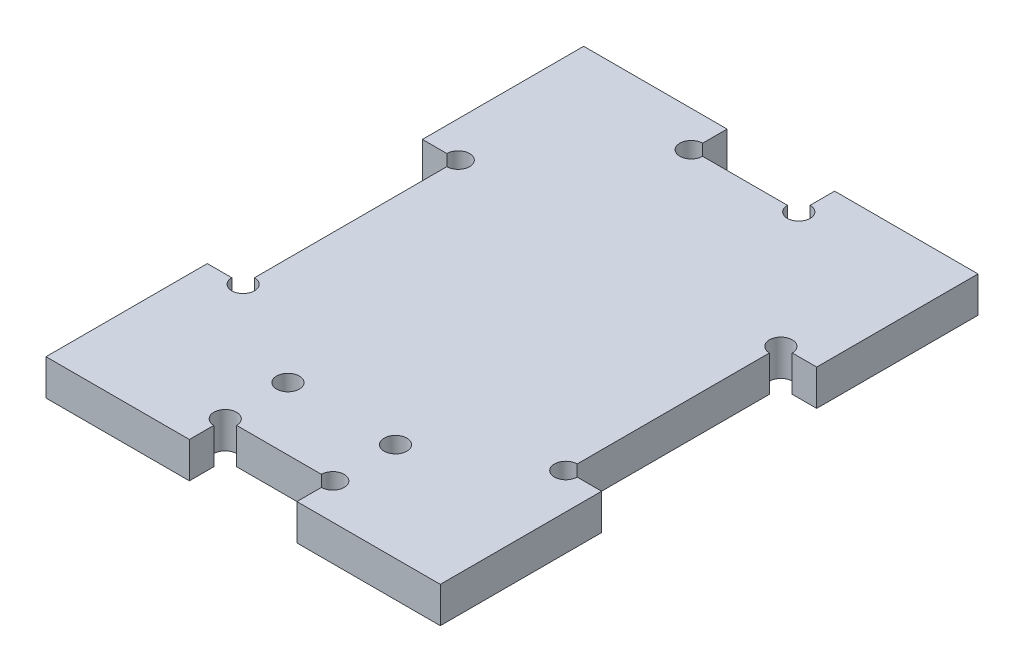
ISO-10303-21;
HEADER;
FILE_DESCRIPTION(('STEP AP214'),'2;1');
FILE_NAME('part.step','',(''),(''),'','','');
FILE_SCHEMA(('AUTOMOTIVE_DESIGN { 1 0 10303 214 1 1 1 1 }'));
ENDSEC;
DATA;
#1=APPLICATION_CONTEXT('core data for automotive mechanical design processes');
#2=APPLICATION_PROTOCOL_DEFINITION('international standard','automotive_design',2000,#1);
#3=PRODUCT_CONTEXT('',#1,'mechanical');
#4=PRODUCT('Part','Part','',(#3));
#5=PRODUCT_RELATED_PRODUCT_CATEGORY('part','',(#4));
#6=PRODUCT_DEFINITION_FORMATION('','',#4);
#7=PRODUCT_DEFINITION_CONTEXT('part definition',#1,'design');
#8=PRODUCT_DEFINITION('design','',#6,#7);
#9=PRODUCT_DEFINITION_SHAPE('','',#8);
#10=(LENGTH_UNIT() NAMED_UNIT(*) SI_UNIT(.MILLI.,.METRE.));
#11=(NAMED_UNIT(*) PLANE_ANGLE_UNIT() SI_UNIT($,.RADIAN.));
#12=(NAMED_UNIT(*) SI_UNIT($,.STERADIAN.) SOLID_ANGLE_UNIT());
#13=UNCERTAINTY_MEASURE_WITH_UNIT(LENGTH_MEASURE(1.E-05),#10,'distance_accuracy_value','');
#14=(GEOMETRIC_REPRESENTATION_CONTEXT(3) GLOBAL_UNCERTAINTY_ASSIGNED_CONTEXT((#13)) GLOBAL_UNIT_ASSIGNED_CONTEXT((#10,
#11,#12)) REPRESENTATION_CONTEXT('',''));
#15=CARTESIAN_POINT('',(0.,0.,0.));
#16=DIRECTION('',(0.,0.,1.));
#17=DIRECTION('',(1.,0.,0.));
#18=AXIS2_PLACEMENT_3D('',#15,#16,#17);
#19=CARTESIAN_POINT('',(0.,5.,0.));
#20=DIRECTION('',(1.,0.,0.));
#21=DIRECTION('',(0.,0.,-1.));
#22=AXIS2_PLACEMENT_3D('',#19,#20,#21);
#23=PLANE('',#22);
#24=DIRECTION('',(0.,0.,1.));
#25=VECTOR('',#24,1.);
#26=CARTESIAN_POINT('',(0.,0.,0.));
#27=LINE('',#26,#25);
#28=CARTESIAN_POINT('',(0.,0.,-75.));
#29=VERTEX_POINT('',#28);
#30=CARTESIAN_POINT('',(0.,0.,-52.5));
#31=VERTEX_POINT('',#30);
#32=EDGE_CURVE('E286',#29,#31,#27,.T.);
#33=ORIENTED_EDGE('',*,*,#32,.T.);
#34=DIRECTION('',(0.,1.,0.));
#35=VECTOR('',#34,1.);
#36=CARTESIAN_POINT('',(0.,0.,-52.5));
#37=LINE('',#36,#35);
#38=CARTESIAN_POINT('',(0.,5.,-52.5));
#39=VERTEX_POINT('',#38);
#40=EDGE_CURVE('E380',#31,#39,#37,.T.);
#41=ORIENTED_EDGE('',*,*,#40,.T.);
#42=DIRECTION('',(0.,0.,1.));
#43=VECTOR('',#42,1.);
#44=CARTESIAN_POINT('',(0.,5.,0.));
#45=LINE('',#44,#43);
#46=CARTESIAN_POINT('',(0.,5.,-75.));
#47=VERTEX_POINT('',#46);
#48=EDGE_CURVE('E265',#47,#39,#45,.T.);
#49=ORIENTED_EDGE('',*,*,#48,.F.);
#50=DIRECTION('',(0.,-1.,0.));
#51=VECTOR('',#50,1.);
#52=CARTESIAN_POINT('',(0.,5.,-75.));
#53=LINE('',#52,#51);
#54=EDGE_CURVE('E285',#47,#29,#53,.T.);
#55=ORIENTED_EDGE('',*,*,#54,.T.);
#56=EDGE_LOOP('',(#33,#41,#49,#55));
#57=FACE_BOUND('',#56,.T.);
#58=ADVANCED_FACE('F39',(#57),#23,.F.);
#59=CARTESIAN_POINT('',(0.,5.,0.));
#60=DIRECTION('',(0.,0.,-1.));
#61=DIRECTION('',(-1.,0.,0.));
#62=AXIS2_PLACEMENT_3D('',#59,#60,#61);
#63=PLANE('',#62);
#64=DIRECTION('',(1.,0.,0.));
#65=VECTOR('',#64,1.);
#66=CARTESIAN_POINT('',(0.,0.,0.));
#67=LINE('',#66,#65);
#68=CARTESIAN_POINT('',(0.,0.,0.));
#69=VERTEX_POINT('',#68);
#70=CARTESIAN_POINT('',(20.,0.,0.));
#71=VERTEX_POINT('',#70);
#72=EDGE_CURVE('E291',#69,#71,#67,.T.);
#73=ORIENTED_EDGE('',*,*,#72,.T.);
#74=DIRECTION('',(0.,1.,0.));
#75=VECTOR('',#74,1.);
#76=CARTESIAN_POINT('',(20.,0.,0.));
#77=LINE('',#76,#75);
#78=CARTESIAN_POINT('',(20.,5.,0.));
#79=VERTEX_POINT('',#78);
#80=EDGE_CURVE('E364',#71,#79,#77,.T.);
#81=ORIENTED_EDGE('',*,*,#80,.T.);
#82=DIRECTION('',(1.,0.,0.));
#83=VECTOR('',#82,1.);
#84=CARTESIAN_POINT('',(0.,5.,0.));
#85=LINE('',#84,#83);
#86=CARTESIAN_POINT('',(0.,5.,0.));
#87=VERTEX_POINT('',#86);
#88=EDGE_CURVE('E271',#87,#79,#85,.T.);
#89=ORIENTED_EDGE('',*,*,#88,.F.);
#90=DIRECTION('',(0.,-1.,0.));
#91=VECTOR('',#90,1.);
#92=CARTESIAN_POINT('',(0.,5.,0.));
#93=LINE('',#92,#91);
#94=EDGE_CURVE('E316',#87,#69,#93,.T.);
#95=ORIENTED_EDGE('',*,*,#94,.T.);
#96=EDGE_LOOP('',(#73,#81,#89,#95));
#97=FACE_BOUND('',#96,.T.);
#98=ADVANCED_FACE('F481',(#97),#63,.F.);
#99=CARTESIAN_POINT('',(55.,5.,0.));
#100=DIRECTION('',(-1.,0.,0.));
#101=DIRECTION('',(0.,0.,1.));
#102=AXIS2_PLACEMENT_3D('',#99,#100,#101);
#103=PLANE('',#102);
#104=DIRECTION('',(0.,0.,-1.));
#105=VECTOR('',#104,1.);
#106=CARTESIAN_POINT('',(55.,0.,0.));
#107=LINE('',#106,#105);
#108=CARTESIAN_POINT('',(55.,0.,0.));
#109=VERTEX_POINT('',#108);
#110=CARTESIAN_POINT('',(55.,0.,-22.5));
#111=VERTEX_POINT('',#110);
#112=EDGE_CURVE('E296',#109,#111,#107,.T.);
#113=ORIENTED_EDGE('',*,*,#112,.T.);
#114=DIRECTION('',(0.,1.,0.));
#115=VECTOR('',#114,1.);
#116=CARTESIAN_POINT('',(55.,0.,-22.5));
#117=LINE('',#116,#115);
#118=CARTESIAN_POINT('',(55.,5.,-22.5));
#119=VERTEX_POINT('',#118);
#120=EDGE_CURVE('E445',#111,#119,#117,.T.);
#121=ORIENTED_EDGE('',*,*,#120,.T.);
#122=DIRECTION('',(0.,0.,-1.));
#123=VECTOR('',#122,1.);
#124=CARTESIAN_POINT('',(55.,5.,0.));
#125=LINE('',#124,#123);
#126=CARTESIAN_POINT('',(55.,5.,0.));
#127=VERTEX_POINT('',#126);
#128=EDGE_CURVE('E276',#127,#119,#125,.T.);
#129=ORIENTED_EDGE('',*,*,#128,.F.);
#130=DIRECTION('',(0.,-1.,0.));
#131=VECTOR('',#130,1.);
#132=CARTESIAN_POINT('',(55.,5.,0.));
#133=LINE('',#132,#131);
#134=EDGE_CURVE('E312',#127,#109,#133,.T.);
#135=ORIENTED_EDGE('',*,*,#134,.T.);
#136=EDGE_LOOP('',(#113,#121,#129,#135));
#137=FACE_BOUND('',#136,.T.);
#138=ADVANCED_FACE('F603',(#137),#103,.F.);
#139=CARTESIAN_POINT('',(0.,5.,-75.));
#140=DIRECTION('',(0.,0.,1.));
#141=DIRECTION('',(1.,0.,0.));
#142=AXIS2_PLACEMENT_3D('',#139,#140,#141);
#143=PLANE('',#142);
#144=DIRECTION('',(-1.,0.,0.));
#145=VECTOR('',#144,1.);
#146=CARTESIAN_POINT('',(0.,0.,-75.));
#147=LINE('',#146,#145);
#148=CARTESIAN_POINT('',(55.,0.,-75.));
#149=VERTEX_POINT('',#148);
#150=CARTESIAN_POINT('',(35.,0.,-75.));
#151=VERTEX_POINT('',#150);
#152=EDGE_CURVE('E301',#149,#151,#147,.T.);
#153=ORIENTED_EDGE('',*,*,#152,.T.);
#154=DIRECTION('',(0.,1.,0.));
#155=VECTOR('',#154,1.);
#156=CARTESIAN_POINT('',(35.,0.,-75.));
#157=LINE('',#156,#155);
#158=CARTESIAN_POINT('',(35.,5.,-75.));
#159=VERTEX_POINT('',#158);
#160=EDGE_CURVE('E416',#151,#159,#157,.T.);
#161=ORIENTED_EDGE('',*,*,#160,.T.);
#162=DIRECTION('',(-1.,0.,0.));
#163=VECTOR('',#162,1.);
#164=CARTESIAN_POINT('',(0.,5.,-75.));
#165=LINE('',#164,#163);
#166=CARTESIAN_POINT('',(55.,5.,-75.));
#167=VERTEX_POINT('',#166);
#168=EDGE_CURVE('E281',#167,#159,#165,.T.);
#169=ORIENTED_EDGE('',*,*,#168,.F.);
#170=DIRECTION('',(0.,-1.,0.));
#171=VECTOR('',#170,1.);
#172=CARTESIAN_POINT('',(55.,5.,-75.));
#173=LINE('',#172,#171);
#174=EDGE_CURVE('E308',#167,#149,#173,.T.);
#175=ORIENTED_EDGE('',*,*,#174,.T.);
#176=EDGE_LOOP('',(#153,#161,#169,#175));
#177=FACE_BOUND('',#176,.T.);
#178=ADVANCED_FACE('F419',(#177),#143,.F.);
#179=CARTESIAN_POINT('',(0.,5.,-22.5));
#180=VERTEX_POINT('',#179);
#181=EDGE_CURVE('E270',#180,#87,#45,.T.);
#182=ORIENTED_EDGE('',*,*,#181,.F.);
#183=DIRECTION('',(0.,1.,0.));
#184=VECTOR('',#183,1.);
#185=CARTESIAN_POINT('',(0.,0.,-22.5));
#186=LINE('',#185,#184);
#187=CARTESIAN_POINT('',(0.,0.,-22.5));
#188=VERTEX_POINT('',#187);
#189=EDGE_CURVE('E475',#188,#180,#186,.T.);
#190=ORIENTED_EDGE('',*,*,#189,.F.);
#191=EDGE_CURVE('E259',#188,#69,#27,.T.);
#192=ORIENTED_EDGE('',*,*,#191,.T.);
#193=ORIENTED_EDGE('',*,*,#94,.F.);
#194=EDGE_LOOP('',(#182,#190,#192,#193));
#195=FACE_BOUND('',#194,.T.);
#196=ADVANCED_FACE('F41',(#195),#23,.F.);
#197=CARTESIAN_POINT('',(35.,5.,0.));
#198=VERTEX_POINT('',#197);
#199=EDGE_CURVE('E269',#198,#127,#85,.T.);
#200=ORIENTED_EDGE('',*,*,#199,.F.);
#201=DIRECTION('',(0.,1.,0.));
#202=VECTOR('',#201,1.);
#203=CARTESIAN_POINT('',(35.,0.,0.));
#204=LINE('',#203,#202);
#205=CARTESIAN_POINT('',(35.,0.,0.));
#206=VERTEX_POINT('',#205);
#207=EDGE_CURVE('E370',#206,#198,#204,.T.);
#208=ORIENTED_EDGE('',*,*,#207,.F.);
#209=EDGE_CURVE('E290',#206,#109,#67,.T.);
#210=ORIENTED_EDGE('',*,*,#209,.T.);
#211=ORIENTED_EDGE('',*,*,#134,.F.);
#212=EDGE_LOOP('',(#200,#208,#210,#211));
#213=FACE_BOUND('',#212,.T.);
#214=ADVANCED_FACE('F604',(#213),#63,.F.);
#215=CARTESIAN_POINT('',(55.,5.,-52.5));
#216=VERTEX_POINT('',#215);
#217=EDGE_CURVE('E275',#216,#167,#125,.T.);
#218=ORIENTED_EDGE('',*,*,#217,.F.);
#219=DIRECTION('',(0.,1.,0.));
#220=VECTOR('',#219,1.);
#221=CARTESIAN_POINT('',(55.,0.,-52.5));
#222=LINE('',#221,#220);
#223=CARTESIAN_POINT('',(55.,0.,-52.5));
#224=VERTEX_POINT('',#223);
#225=EDGE_CURVE('E444',#224,#216,#222,.T.);
#226=ORIENTED_EDGE('',*,*,#225,.F.);
#227=EDGE_CURVE('E295',#224,#149,#107,.T.);
#228=ORIENTED_EDGE('',*,*,#227,.T.);
#229=ORIENTED_EDGE('',*,*,#174,.F.);
#230=EDGE_LOOP('',(#218,#226,#228,#229));
#231=FACE_BOUND('',#230,.T.);
#232=ADVANCED_FACE('F459',(#231),#103,.F.);
#233=CARTESIAN_POINT('',(20.,5.,-75.));
#234=VERTEX_POINT('',#233);
#235=EDGE_CURVE('E280',#234,#47,#165,.T.);
#236=ORIENTED_EDGE('',*,*,#235,.F.);
#237=DIRECTION('',(0.,1.,0.));
#238=VECTOR('',#237,1.);
#239=CARTESIAN_POINT('',(20.,0.,-75.));
#240=LINE('',#239,#238);
#241=CARTESIAN_POINT('',(20.,0.,-75.));
#242=VERTEX_POINT('',#241);
#243=EDGE_CURVE('E422',#242,#234,#240,.T.);
#244=ORIENTED_EDGE('',*,*,#243,.F.);
#245=EDGE_CURVE('E300',#242,#29,#147,.T.);
#246=ORIENTED_EDGE('',*,*,#245,.T.);
#247=ORIENTED_EDGE('',*,*,#54,.F.);
#248=EDGE_LOOP('',(#236,#244,#246,#247));
#249=FACE_BOUND('',#248,.T.);
#250=ADVANCED_FACE('F509',(#249),#143,.F.);
#251=CARTESIAN_POINT('',(0.,5.,0.));
#252=DIRECTION('',(0.,-1.,0.));
#253=DIRECTION('',(0.,0.,-1.));
#254=AXIS2_PLACEMENT_3D('',#251,#252,#253);
#255=PLANE('',#254);
#256=CARTESIAN_POINT('',(35.,5.,-13.75));
#257=DIRECTION('',(0.,1.,0.));
#258=DIRECTION('',(0.,0.,1.));
#259=AXIS2_PLACEMENT_3D('',#256,#257,#258);
#260=CIRCLE('',#259,1.5875);
#261=CARTESIAN_POINT('',(35.,5.,-12.1625));
#262=VERTEX_POINT('',#261);
#263=EDGE_CURVE('E523',#262,#262,#260,.T.);
#264=ORIENTED_EDGE('',*,*,#263,.F.);
#265=EDGE_LOOP('',(#264));
#266=FACE_BOUND('',#265,.T.);
#267=CARTESIAN_POINT('',(20.,5.,-13.75));
#268=DIRECTION('',(0.,1.,0.));
#269=DIRECTION('',(0.,0.,1.));
#270=AXIS2_PLACEMENT_3D('',#267,#268,#269);
#271=CIRCLE('',#270,1.5875);
#272=CARTESIAN_POINT('',(20.,5.,-12.1625));
#273=VERTEX_POINT('',#272);
#274=EDGE_CURVE('E884',#273,#273,#271,.T.);
#275=ORIENTED_EDGE('',*,*,#274,.F.);
#276=EDGE_LOOP('',(#275));
#277=FACE_BOUND('',#276,.T.);
#278=DIRECTION('',(0.,0.,-1.));
#279=VECTOR('',#278,1.);
#280=CARTESIAN_POINT('',(50.,5.,0.));
#281=LINE('',#280,#279);
#282=CARTESIAN_POINT('',(50.,5.,-24.0875));
#283=VERTEX_POINT('',#282);
#284=CARTESIAN_POINT('',(50.,5.,-50.9125));
#285=VERTEX_POINT('',#284);
#286=EDGE_CURVE('E391',#283,#285,#281,.T.);
#287=ORIENTED_EDGE('',*,*,#286,.T.);
#288=CARTESIAN_POINT('',(50.,5.,-52.5));
#289=DIRECTION('',(0.,1.,0.));
#290=DIRECTION('',(0.,0.,1.));
#291=AXIS2_PLACEMENT_3D('',#288,#289,#290);
#292=CIRCLE('',#291,1.5875);
#293=CARTESIAN_POINT('',(51.5875,5.,-52.5));
#294=VERTEX_POINT('',#293);
#295=EDGE_CURVE('E535',#294,#285,#292,.T.);
#296=ORIENTED_EDGE('',*,*,#295,.F.);
#297=DIRECTION('',(1.,0.,0.));
#298=VECTOR('',#297,1.);
#299=CARTESIAN_POINT('',(0.,5.,-52.4999999999999));
#300=LINE('',#299,#298);
#301=EDGE_CURVE('E388',#294,#216,#300,.T.);
#302=ORIENTED_EDGE('',*,*,#301,.T.);
#303=ORIENTED_EDGE('',*,*,#217,.T.);
#304=ORIENTED_EDGE('',*,*,#168,.T.);
#305=DIRECTION('',(0.,0.,1.));
#306=VECTOR('',#305,1.);
#307=CARTESIAN_POINT('',(34.9999999999996,5.,1.94289029309401E-13));
#308=LINE('',#307,#306);
#309=CARTESIAN_POINT('',(35.,5.,-71.5875));
#310=VERTEX_POINT('',#309);
#311=EDGE_CURVE('E261',#159,#310,#308,.T.);
#312=ORIENTED_EDGE('',*,*,#311,.T.);
#313=CARTESIAN_POINT('',(35.,5.,-70.));
#314=DIRECTION('',(0.,1.,0.));
#315=DIRECTION('',(0.,0.,1.));
#316=AXIS2_PLACEMENT_3D('',#313,#314,#315);
#317=CIRCLE('',#316,1.5875);
#318=CARTESIAN_POINT('',(33.4125,5.,-70.));
#319=VERTEX_POINT('',#318);
#320=EDGE_CURVE('E407',#319,#310,#317,.T.);
#321=ORIENTED_EDGE('',*,*,#320,.F.);
#322=DIRECTION('',(-1.,0.,0.));
#323=VECTOR('',#322,1.);
#324=CARTESIAN_POINT('',(0.,5.,-70.));
#325=LINE('',#324,#323);
#326=CARTESIAN_POINT('',(21.5875,5.,-70.));
#327=VERTEX_POINT('',#326);
#328=EDGE_CURVE('E401',#319,#327,#325,.T.);
#329=ORIENTED_EDGE('',*,*,#328,.T.);
#330=CARTESIAN_POINT('',(20.,5.,-70.));
#331=DIRECTION('',(0.,1.,0.));
#332=DIRECTION('',(0.,0.,1.));
#333=AXIS2_PLACEMENT_3D('',#330,#331,#332);
#334=CIRCLE('',#333,1.5875);
#335=CARTESIAN_POINT('',(20.,5.,-71.5875));
#336=VERTEX_POINT('',#335);
#337=EDGE_CURVE('E513',#336,#327,#334,.T.);
#338=ORIENTED_EDGE('',*,*,#337,.F.);
#339=DIRECTION('',(0.,0.,-1.));
#340=VECTOR('',#339,1.);
#341=CARTESIAN_POINT('',(20.0000000000001,5.,0.));
#342=LINE('',#341,#340);
#343=EDGE_CURVE('E398',#336,#234,#342,.T.);
#344=ORIENTED_EDGE('',*,*,#343,.T.);
#345=ORIENTED_EDGE('',*,*,#235,.T.);
#346=ORIENTED_EDGE('',*,*,#48,.T.);
#347=DIRECTION('',(1.,0.,0.));
#348=VECTOR('',#347,1.);
#349=CARTESIAN_POINT('',(0.,5.,-52.5));
#350=LINE('',#349,#348);
#351=CARTESIAN_POINT('',(3.41249999999999,5.,-52.5));
#352=VERTEX_POINT('',#351);
#353=EDGE_CURVE('E254',#39,#352,#350,.T.);
#354=ORIENTED_EDGE('',*,*,#353,.T.);
#355=CARTESIAN_POINT('',(4.99999999999999,5.,-52.5));
#356=DIRECTION('',(0.,1.,0.));
#357=DIRECTION('',(0.,0.,1.));
#358=AXIS2_PLACEMENT_3D('',#355,#356,#357);
#359=CIRCLE('',#358,1.5875);
#360=CARTESIAN_POINT('',(4.99999999999999,5.,-50.9125));
#361=VERTEX_POINT('',#360);
#362=EDGE_CURVE('E252',#361,#352,#359,.T.);
#363=ORIENTED_EDGE('',*,*,#362,.F.);
#364=DIRECTION('',(0.,0.,1.));
#365=VECTOR('',#364,1.);
#366=CARTESIAN_POINT('',(4.99999999999999,5.,0.));
#367=LINE('',#366,#365);
#368=CARTESIAN_POINT('',(4.99999999999999,5.,-24.0875));
#369=VERTEX_POINT('',#368);
#370=EDGE_CURVE('E241',#361,#369,#367,.T.);
#371=ORIENTED_EDGE('',*,*,#370,.T.);
#372=CARTESIAN_POINT('',(4.99999999999999,5.,-22.5));
#373=DIRECTION('',(0.,1.,0.));
#374=DIRECTION('',(0.,0.,1.));
#375=AXIS2_PLACEMENT_3D('',#372,#373,#374);
#376=CIRCLE('',#375,1.5875);
#377=CARTESIAN_POINT('',(3.41249999999999,5.,-22.5));
#378=VERTEX_POINT('',#377);
#379=EDGE_CURVE('E223',#378,#369,#376,.T.);
#380=ORIENTED_EDGE('',*,*,#379,.F.);
#381=DIRECTION('',(-1.,0.,0.));
#382=VECTOR('',#381,1.);
#383=CARTESIAN_POINT('',(0.,5.,-22.5));
#384=LINE('',#383,#382);
#385=EDGE_CURVE('E255',#378,#180,#384,.T.);
#386=ORIENTED_EDGE('',*,*,#385,.T.);
#387=ORIENTED_EDGE('',*,*,#181,.T.);
#388=ORIENTED_EDGE('',*,*,#88,.T.);
#389=DIRECTION('',(0.,0.,-1.));
#390=VECTOR('',#389,1.);
#391=CARTESIAN_POINT('',(20.,5.,0.));
#392=LINE('',#391,#390);
#393=CARTESIAN_POINT('',(20.,5.,-3.41249999999999));
#394=VERTEX_POINT('',#393);
#395=EDGE_CURVE('E384',#79,#394,#392,.T.);
#396=ORIENTED_EDGE('',*,*,#395,.T.);
#397=CARTESIAN_POINT('',(20.,5.,-4.99999999999999));
#398=DIRECTION('',(0.,1.,0.));
#399=DIRECTION('',(0.,0.,1.));
#400=AXIS2_PLACEMENT_3D('',#397,#398,#399);
#401=CIRCLE('',#400,1.5875);
#402=CARTESIAN_POINT('',(21.5875,5.,-4.99999999999999));
#403=VERTEX_POINT('',#402);
#404=EDGE_CURVE('E548',#403,#394,#401,.T.);
#405=ORIENTED_EDGE('',*,*,#404,.F.);
#406=DIRECTION('',(1.,0.,0.));
#407=VECTOR('',#406,1.);
#408=CARTESIAN_POINT('',(0.,5.,-4.99999999999998));
#409=LINE('',#408,#407);
#410=CARTESIAN_POINT('',(33.4125,5.,-4.99999999999999));
#411=VERTEX_POINT('',#410);
#412=EDGE_CURVE('E379',#403,#411,#409,.T.);
#413=ORIENTED_EDGE('',*,*,#412,.T.);
#414=CARTESIAN_POINT('',(35.,5.,-4.99999999999999));
#415=DIRECTION('',(0.,1.,0.));
#416=DIRECTION('',(0.,0.,1.));
#417=AXIS2_PLACEMENT_3D('',#414,#415,#416);
#418=CIRCLE('',#417,1.5875);
#419=CARTESIAN_POINT('',(35.,5.,-3.41249999999999));
#420=VERTEX_POINT('',#419);
#421=EDGE_CURVE('E553',#420,#411,#418,.T.);
#422=ORIENTED_EDGE('',*,*,#421,.F.);
#423=DIRECTION('',(0.,0.,1.));
#424=VECTOR('',#423,1.);
#425=CARTESIAN_POINT('',(35.,5.,-1.94289029309403E-13));
#426=LINE('',#425,#424);
#427=EDGE_CURVE('E348',#420,#198,#426,.T.);
#428=ORIENTED_EDGE('',*,*,#427,.T.);
#429=ORIENTED_EDGE('',*,*,#199,.T.);
#430=ORIENTED_EDGE('',*,*,#128,.T.);
#431=DIRECTION('',(-1.,0.,0.));
#432=VECTOR('',#431,1.);
#433=CARTESIAN_POINT('',(0.,5.,-22.5));
#434=LINE('',#433,#432);
#435=CARTESIAN_POINT('',(51.5875,5.,-22.5));
#436=VERTEX_POINT('',#435);
#437=EDGE_CURVE('E394',#119,#436,#434,.T.);
#438=ORIENTED_EDGE('',*,*,#437,.T.);
#439=CARTESIAN_POINT('',(50.,5.,-22.5));
#440=DIRECTION('',(0.,1.,0.));
#441=DIRECTION('',(0.,0.,1.));
#442=AXIS2_PLACEMENT_3D('',#439,#440,#441);
#443=CIRCLE('',#442,1.5875);
#444=EDGE_CURVE('E534',#283,#436,#443,.T.);
#445=ORIENTED_EDGE('',*,*,#444,.F.);
#446=EDGE_LOOP('',(#287,#296,#302,#303,#304,#312,#321,#329,#338,#344,#345,#346,#354,#363,#371,
#380,#386,#387,#388,#396,#405,#413,#422,#428,#429,#430,#438,#445));
#447=FACE_BOUND('',#446,.T.);
#448=ADVANCED_FACE('F250',(#266,#277,#447),#255,.F.);
#449=CARTESIAN_POINT('',(0.,0.,0.));
#450=DIRECTION('',(0.,-1.,0.));
#451=DIRECTION('',(0.,0.,-1.));
#452=AXIS2_PLACEMENT_3D('',#449,#450,#451);
#453=PLANE('',#452);
#454=CARTESIAN_POINT('',(50.,0.,-52.5));
#455=DIRECTION('',(0.,1.,0.));
#456=DIRECTION('',(0.,0.,1.));
#457=AXIS2_PLACEMENT_3D('',#454,#455,#456);
#458=CIRCLE('',#457,1.5875);
#459=CARTESIAN_POINT('',(51.5875,0.,-52.5));
#460=VERTEX_POINT('',#459);
#461=CARTESIAN_POINT('',(50.,0.,-50.9125));
#462=VERTEX_POINT('',#461);
#463=EDGE_CURVE('E531',#460,#462,#458,.T.);
#464=ORIENTED_EDGE('',*,*,#463,.T.);
#465=DIRECTION('',(0.,0.,1.));
#466=VECTOR('',#465,1.);
#467=CARTESIAN_POINT('',(50.,0.,-52.5));
#468=LINE('',#467,#466);
#469=CARTESIAN_POINT('',(50.,0.,-24.0875));
#470=VERTEX_POINT('',#469);
#471=EDGE_CURVE('E437',#462,#470,#468,.T.);
#472=ORIENTED_EDGE('',*,*,#471,.T.);
#473=CARTESIAN_POINT('',(50.,0.,-22.5));
#474=DIRECTION('',(0.,1.,0.));
#475=DIRECTION('',(0.,0.,1.));
#476=AXIS2_PLACEMENT_3D('',#473,#474,#475);
#477=CIRCLE('',#476,1.5875);
#478=CARTESIAN_POINT('',(51.5875,0.,-22.5));
#479=VERTEX_POINT('',#478);
#480=EDGE_CURVE('E556',#470,#479,#477,.T.);
#481=ORIENTED_EDGE('',*,*,#480,.T.);
#482=DIRECTION('',(1.,0.,0.));
#483=VECTOR('',#482,1.);
#484=CARTESIAN_POINT('',(55.,0.,-22.5));
#485=LINE('',#484,#483);
#486=EDGE_CURVE('E441',#479,#111,#485,.T.);
#487=ORIENTED_EDGE('',*,*,#486,.T.);
#488=ORIENTED_EDGE('',*,*,#112,.F.);
#489=ORIENTED_EDGE('',*,*,#209,.F.);
#490=DIRECTION('',(0.,0.,-1.));
#491=VECTOR('',#490,1.);
#492=CARTESIAN_POINT('',(35.,0.,0.));
#493=LINE('',#492,#491);
#494=CARTESIAN_POINT('',(35.,0.,-3.41249999999999));
#495=VERTEX_POINT('',#494);
#496=EDGE_CURVE('E346',#206,#495,#493,.T.);
#497=ORIENTED_EDGE('',*,*,#496,.T.);
#498=CARTESIAN_POINT('',(35.,0.,-4.99999999999999));
#499=DIRECTION('',(0.,1.,0.));
#500=DIRECTION('',(0.,0.,1.));
#501=AXIS2_PLACEMENT_3D('',#498,#499,#500);
#502=CIRCLE('',#501,1.5875);
#503=CARTESIAN_POINT('',(33.4125,0.,-4.99999999999999));
#504=VERTEX_POINT('',#503);
#505=EDGE_CURVE('E62',#495,#504,#502,.T.);
#506=ORIENTED_EDGE('',*,*,#505,.T.);
#507=DIRECTION('',(-1.,0.,0.));
#508=VECTOR('',#507,1.);
#509=CARTESIAN_POINT('',(20.,0.,-4.99999999999999));
#510=LINE('',#509,#508);
#511=CARTESIAN_POINT('',(21.5875,0.,-4.99999999999999));
#512=VERTEX_POINT('',#511);
#513=EDGE_CURVE('E359',#504,#512,#510,.T.);
#514=ORIENTED_EDGE('',*,*,#513,.T.);
#515=CARTESIAN_POINT('',(20.,0.,-4.99999999999999));
#516=DIRECTION('',(0.,1.,0.));
#517=DIRECTION('',(0.,0.,1.));
#518=AXIS2_PLACEMENT_3D('',#515,#516,#517);
#519=CIRCLE('',#518,1.5875);
#520=CARTESIAN_POINT('',(20.,0.,-3.41249999999999));
#521=VERTEX_POINT('',#520);
#522=EDGE_CURVE('E55',#512,#521,#519,.T.);
#523=ORIENTED_EDGE('',*,*,#522,.T.);
#524=DIRECTION('',(0.,0.,1.));
#525=VECTOR('',#524,1.);
#526=CARTESIAN_POINT('',(20.,0.,0.));
#527=LINE('',#526,#525);
#528=EDGE_CURVE('E360',#521,#71,#527,.T.);
#529=ORIENTED_EDGE('',*,*,#528,.T.);
#530=ORIENTED_EDGE('',*,*,#72,.F.);
#531=ORIENTED_EDGE('',*,*,#191,.F.);
#532=DIRECTION('',(1.,0.,0.));
#533=VECTOR('',#532,1.);
#534=CARTESIAN_POINT('',(0.,0.,-22.5));
#535=LINE('',#534,#533);
#536=CARTESIAN_POINT('',(3.41249999999999,0.,-22.5));
#537=VERTEX_POINT('',#536);
#538=EDGE_CURVE('E428',#188,#537,#535,.T.);
#539=ORIENTED_EDGE('',*,*,#538,.T.);
#540=CARTESIAN_POINT('',(4.99999999999999,0.,-22.5));
#541=DIRECTION('',(0.,1.,0.));
#542=DIRECTION('',(0.,0.,1.));
#543=AXIS2_PLACEMENT_3D('',#540,#541,#542);
#544=CIRCLE('',#543,1.5875);
#545=CARTESIAN_POINT('',(4.99999999999999,0.,-24.0875));
#546=VERTEX_POINT('',#545);
#547=EDGE_CURVE('E234',#537,#546,#544,.T.);
#548=ORIENTED_EDGE('',*,*,#547,.T.);
#549=DIRECTION('',(0.,0.,-1.));
#550=VECTOR('',#549,1.);
#551=CARTESIAN_POINT('',(4.99999999999999,0.,-22.5));
#552=LINE('',#551,#550);
#553=CARTESIAN_POINT('',(4.99999999999999,0.,-50.9125));
#554=VERTEX_POINT('',#553);
#555=EDGE_CURVE('E243',#546,#554,#552,.T.);
#556=ORIENTED_EDGE('',*,*,#555,.T.);
#557=CARTESIAN_POINT('',(4.99999999999999,0.,-52.5));
#558=DIRECTION('',(0.,1.,0.));
#559=DIRECTION('',(0.,0.,1.));
#560=AXIS2_PLACEMENT_3D('',#557,#558,#559);
#561=CIRCLE('',#560,1.5875);
#562=CARTESIAN_POINT('',(3.41249999999999,0.,-52.5));
#563=VERTEX_POINT('',#562);
#564=EDGE_CURVE('E246',#554,#563,#561,.T.);
#565=ORIENTED_EDGE('',*,*,#564,.T.);
#566=DIRECTION('',(-1.,0.,0.));
#567=VECTOR('',#566,1.);
#568=CARTESIAN_POINT('',(0.,0.,-52.5));
#569=LINE('',#568,#567);
#570=EDGE_CURVE('E486',#563,#31,#569,.T.);
#571=ORIENTED_EDGE('',*,*,#570,.T.);
#572=ORIENTED_EDGE('',*,*,#32,.F.);
#573=ORIENTED_EDGE('',*,*,#245,.F.);
#574=DIRECTION('',(0.,0.,1.));
#575=VECTOR('',#574,1.);
#576=CARTESIAN_POINT('',(20.,0.,-75.));
#577=LINE('',#576,#575);
#578=CARTESIAN_POINT('',(20.,0.,-71.5875));
#579=VERTEX_POINT('',#578);
#580=EDGE_CURVE('E431',#242,#579,#577,.T.);
#581=ORIENTED_EDGE('',*,*,#580,.T.);
#582=CARTESIAN_POINT('',(20.,0.,-70.));
#583=DIRECTION('',(0.,1.,0.));
#584=DIRECTION('',(0.,0.,1.));
#585=AXIS2_PLACEMENT_3D('',#582,#583,#584);
#586=CIRCLE('',#585,1.5875);
#587=CARTESIAN_POINT('',(21.5875,0.,-70.));
#588=VERTEX_POINT('',#587);
#589=EDGE_CURVE('E500',#579,#588,#586,.T.);
#590=ORIENTED_EDGE('',*,*,#589,.T.);
#591=DIRECTION('',(1.,0.,0.));
#592=VECTOR('',#591,1.);
#593=CARTESIAN_POINT('',(35.,0.,-70.));
#594=LINE('',#593,#592);
#595=CARTESIAN_POINT('',(33.4125,0.,-70.));
#596=VERTEX_POINT('',#595);
#597=EDGE_CURVE('E423',#588,#596,#594,.T.);
#598=ORIENTED_EDGE('',*,*,#597,.T.);
#599=CARTESIAN_POINT('',(35.,0.,-70.));
#600=DIRECTION('',(0.,1.,0.));
#601=DIRECTION('',(0.,0.,1.));
#602=AXIS2_PLACEMENT_3D('',#599,#600,#601);
#603=CIRCLE('',#602,1.5875);
#604=CARTESIAN_POINT('',(35.,0.,-71.5875));
#605=VERTEX_POINT('',#604);
#606=EDGE_CURVE('E538',#596,#605,#603,.T.);
#607=ORIENTED_EDGE('',*,*,#606,.T.);
#608=DIRECTION('',(0.,0.,-1.));
#609=VECTOR('',#608,1.);
#610=CARTESIAN_POINT('',(35.,0.,-75.));
#611=LINE('',#610,#609);
#612=EDGE_CURVE('E448',#605,#151,#611,.T.);
#613=ORIENTED_EDGE('',*,*,#612,.T.);
#614=ORIENTED_EDGE('',*,*,#152,.F.);
#615=ORIENTED_EDGE('',*,*,#227,.F.);
#616=DIRECTION('',(-1.,0.,0.));
#617=VECTOR('',#616,1.);
#618=CARTESIAN_POINT('',(55.,0.,-52.5));
#619=LINE('',#618,#617);
#620=EDGE_CURVE('E373',#224,#460,#619,.T.);
#621=ORIENTED_EDGE('',*,*,#620,.T.);
#622=EDGE_LOOP('',(#464,#472,#481,#487,#488,#489,#497,#506,#514,#523,#529,#530,#531,#539,#548,
#556,#565,#571,#572,#573,#581,#590,#598,#607,#613,#614,#615,#621));
#623=FACE_BOUND('',#622,.T.);
#624=CARTESIAN_POINT('',(35.,0.,-13.75));
#625=DIRECTION('',(0.,1.,0.));
#626=DIRECTION('',(0.,0.,1.));
#627=AXIS2_PLACEMENT_3D('',#624,#625,#626);
#628=CIRCLE('',#627,1.5875);
#629=CARTESIAN_POINT('',(35.,0.,-12.1625));
#630=VERTEX_POINT('',#629);
#631=EDGE_CURVE('E517',#630,#630,#628,.T.);
#632=ORIENTED_EDGE('',*,*,#631,.T.);
#633=EDGE_LOOP('',(#632));
#634=FACE_BOUND('',#633,.T.);
#635=CARTESIAN_POINT('',(20.,0.,-13.75));
#636=DIRECTION('',(0.,1.,0.));
#637=DIRECTION('',(0.,0.,1.));
#638=AXIS2_PLACEMENT_3D('',#635,#636,#637);
#639=CIRCLE('',#638,1.5875);
#640=CARTESIAN_POINT('',(20.,0.,-12.1625));
#641=VERTEX_POINT('',#640);
#642=EDGE_CURVE('E530',#641,#641,#639,.T.);
#643=ORIENTED_EDGE('',*,*,#642,.T.);
#644=EDGE_LOOP('',(#643));
#645=FACE_BOUND('',#644,.T.);
#646=ADVANCED_FACE('F353',(#623,#634,#645),#453,.T.);
#647=CARTESIAN_POINT('',(20.,0.,0.));
#648=DIRECTION('',(-1.,0.,0.));
#649=DIRECTION('',(0.,0.,1.));
#650=AXIS2_PLACEMENT_3D('',#647,#648,#649);
#651=PLANE('',#650);
#652=ORIENTED_EDGE('',*,*,#528,.F.);
#653=DIRECTION('',(0.,1.,0.));
#654=VECTOR('',#653,1.);
#655=CARTESIAN_POINT('',(20.,0.,-3.41249999999999));
#656=LINE('',#655,#654);
#657=EDGE_CURVE('E366',#521,#394,#656,.T.);
#658=ORIENTED_EDGE('',*,*,#657,.T.);
#659=ORIENTED_EDGE('',*,*,#395,.F.);
#660=ORIENTED_EDGE('',*,*,#80,.F.);
#661=EDGE_LOOP('',(#652,#658,#659,#660));
#662=FACE_BOUND('',#661,.T.);
#663=ADVANCED_FACE('F661',(#662),#651,.F.);
#664=CARTESIAN_POINT('',(20.,0.,-4.99999999999999));
#665=DIRECTION('',(0.,0.,-1.));
#666=DIRECTION('',(-1.,0.,0.));
#667=AXIS2_PLACEMENT_3D('',#664,#665,#666);
#668=PLANE('',#667);
#669=ORIENTED_EDGE('',*,*,#513,.F.);
#670=DIRECTION('',(0.,1.,0.));
#671=VECTOR('',#670,1.);
#672=CARTESIAN_POINT('',(33.4125,0.,-4.99999999999999));
#673=LINE('',#672,#671);
#674=EDGE_CURVE('E583',#504,#411,#673,.T.);
#675=ORIENTED_EDGE('',*,*,#674,.T.);
#676=ORIENTED_EDGE('',*,*,#412,.F.);
#677=DIRECTION('',(0.,1.,0.));
#678=VECTOR('',#677,1.);
#679=CARTESIAN_POINT('',(21.5875,0.,-4.99999999999999));
#680=LINE('',#679,#678);
#681=EDGE_CURVE('E11',#403,#512,#680,.F.);
#682=ORIENTED_EDGE('',*,*,#681,.T.);
#683=EDGE_LOOP('',(#669,#675,#676,#682));
#684=FACE_BOUND('',#683,.T.);
#685=ADVANCED_FACE('F667',(#684),#668,.F.);
#686=CARTESIAN_POINT('',(35.,0.,0.));
#687=DIRECTION('',(1.,0.,0.));
#688=DIRECTION('',(0.,0.,-1.));
#689=AXIS2_PLACEMENT_3D('',#686,#687,#688);
#690=PLANE('',#689);
#691=ORIENTED_EDGE('',*,*,#427,.F.);
#692=DIRECTION('',(0.,1.,0.));
#693=VECTOR('',#692,1.);
#694=CARTESIAN_POINT('',(35.,0.,-3.41249999999999));
#695=LINE('',#694,#693);
#696=EDGE_CURVE('E48',#420,#495,#695,.F.);
#697=ORIENTED_EDGE('',*,*,#696,.T.);
#698=ORIENTED_EDGE('',*,*,#496,.F.);
#699=ORIENTED_EDGE('',*,*,#207,.T.);
#700=EDGE_LOOP('',(#691,#697,#698,#699));
#701=FACE_BOUND('',#700,.T.);
#702=ADVANCED_FACE('F344',(#701),#690,.F.);
#703=CARTESIAN_POINT('',(55.,0.,-22.5));
#704=DIRECTION('',(0.,0.,1.));
#705=DIRECTION('',(1.,0.,0.));
#706=AXIS2_PLACEMENT_3D('',#703,#704,#705);
#707=PLANE('',#706);
#708=ORIENTED_EDGE('',*,*,#486,.F.);
#709=DIRECTION('',(0.,1.,0.));
#710=VECTOR('',#709,1.);
#711=CARTESIAN_POINT('',(51.5875,0.,-22.5));
#712=LINE('',#711,#710);
#713=EDGE_CURVE('E579',#479,#436,#712,.T.);
#714=ORIENTED_EDGE('',*,*,#713,.T.);
#715=ORIENTED_EDGE('',*,*,#437,.F.);
#716=ORIENTED_EDGE('',*,*,#120,.F.);
#717=EDGE_LOOP('',(#708,#714,#715,#716));
#718=FACE_BOUND('',#717,.T.);
#719=ADVANCED_FACE('F685',(#718),#707,.F.);
#720=CARTESIAN_POINT('',(50.,0.,-52.5));
#721=DIRECTION('',(-1.,0.,0.));
#722=DIRECTION('',(0.,0.,1.));
#723=AXIS2_PLACEMENT_3D('',#720,#721,#722);
#724=PLANE('',#723);
#725=ORIENTED_EDGE('',*,*,#471,.F.);
#726=DIRECTION('',(0.,1.,0.));
#727=VECTOR('',#726,1.);
#728=CARTESIAN_POINT('',(50.,0.,-50.9125));
#729=LINE('',#728,#727);
#730=EDGE_CURVE('E575',#462,#285,#729,.T.);
#731=ORIENTED_EDGE('',*,*,#730,.T.);
#732=ORIENTED_EDGE('',*,*,#286,.F.);
#733=DIRECTION('',(0.,1.,0.));
#734=VECTOR('',#733,1.);
#735=CARTESIAN_POINT('',(50.,0.,-24.0875));
#736=LINE('',#735,#734);
#737=EDGE_CURVE('E337',#283,#470,#736,.F.);
#738=ORIENTED_EDGE('',*,*,#737,.T.);
#739=EDGE_LOOP('',(#725,#731,#732,#738));
#740=FACE_BOUND('',#739,.T.);
#741=ADVANCED_FACE('F693',(#740),#724,.F.);
#742=CARTESIAN_POINT('',(55.,0.,-52.5));
#743=DIRECTION('',(0.,0.,-1.));
#744=DIRECTION('',(-1.,0.,0.));
#745=AXIS2_PLACEMENT_3D('',#742,#743,#744);
#746=PLANE('',#745);
#747=ORIENTED_EDGE('',*,*,#301,.F.);
#748=DIRECTION('',(0.,1.,0.));
#749=VECTOR('',#748,1.);
#750=CARTESIAN_POINT('',(51.5875,0.,-52.5));
#751=LINE('',#750,#749);
#752=EDGE_CURVE('E333',#294,#460,#751,.F.);
#753=ORIENTED_EDGE('',*,*,#752,.T.);
#754=ORIENTED_EDGE('',*,*,#620,.F.);
#755=ORIENTED_EDGE('',*,*,#225,.T.);
#756=EDGE_LOOP('',(#747,#753,#754,#755));
#757=FACE_BOUND('',#756,.T.);
#758=ADVANCED_FACE('F455',(#757),#746,.F.);
#759=CARTESIAN_POINT('',(35.,0.,-75.));
#760=DIRECTION('',(1.,0.,0.));
#761=DIRECTION('',(0.,0.,-1.));
#762=AXIS2_PLACEMENT_3D('',#759,#760,#761);
#763=PLANE('',#762);
#764=ORIENTED_EDGE('',*,*,#612,.F.);
#765=DIRECTION('',(0.,1.,0.));
#766=VECTOR('',#765,1.);
#767=CARTESIAN_POINT('',(35.,0.,-71.5875));
#768=LINE('',#767,#766);
#769=EDGE_CURVE('E417',#605,#310,#768,.T.);
#770=ORIENTED_EDGE('',*,*,#769,.T.);
#771=ORIENTED_EDGE('',*,*,#311,.F.);
#772=ORIENTED_EDGE('',*,*,#160,.F.);
#773=EDGE_LOOP('',(#764,#770,#771,#772));
#774=FACE_BOUND('',#773,.T.);
#775=ADVANCED_FACE('F415',(#774),#763,.F.);
#776=CARTESIAN_POINT('',(35.,0.,-70.));
#777=DIRECTION('',(0.,0.,1.));
#778=DIRECTION('',(1.,0.,0.));
#779=AXIS2_PLACEMENT_3D('',#776,#777,#778);
#780=PLANE('',#779);
#781=ORIENTED_EDGE('',*,*,#328,.F.);
#782=DIRECTION('',(0.,1.,0.));
#783=VECTOR('',#782,1.);
#784=CARTESIAN_POINT('',(33.4125,0.,-70.));
#785=LINE('',#784,#783);
#786=EDGE_CURVE('E329',#319,#596,#785,.F.);
#787=ORIENTED_EDGE('',*,*,#786,.T.);
#788=ORIENTED_EDGE('',*,*,#597,.F.);
#789=DIRECTION('',(0.,1.,0.));
#790=VECTOR('',#789,1.);
#791=CARTESIAN_POINT('',(21.5875,0.,-70.));
#792=LINE('',#791,#790);
#793=EDGE_CURVE('E570',#588,#327,#792,.T.);
#794=ORIENTED_EDGE('',*,*,#793,.T.);
#795=EDGE_LOOP('',(#781,#787,#788,#794));
#796=FACE_BOUND('',#795,.T.);
#797=ADVANCED_FACE('F717',(#796),#780,.F.);
#798=CARTESIAN_POINT('',(20.,0.,-75.));
#799=DIRECTION('',(-1.,0.,0.));
#800=DIRECTION('',(0.,0.,1.));
#801=AXIS2_PLACEMENT_3D('',#798,#799,#800);
#802=PLANE('',#801);
#803=ORIENTED_EDGE('',*,*,#343,.F.);
#804=DIRECTION('',(0.,1.,0.));
#805=VECTOR('',#804,1.);
#806=CARTESIAN_POINT('',(20.,0.,-71.5875));
#807=LINE('',#806,#805);
#808=EDGE_CURVE('E325',#336,#579,#807,.F.);
#809=ORIENTED_EDGE('',*,*,#808,.T.);
#810=ORIENTED_EDGE('',*,*,#580,.F.);
#811=ORIENTED_EDGE('',*,*,#243,.T.);
#812=EDGE_LOOP('',(#803,#809,#810,#811));
#813=FACE_BOUND('',#812,.T.);
#814=ADVANCED_FACE('F506',(#813),#802,.F.);
#815=CARTESIAN_POINT('',(0.,0.,-52.5));
#816=DIRECTION('',(0.,0.,-1.));
#817=DIRECTION('',(-1.,0.,0.));
#818=AXIS2_PLACEMENT_3D('',#815,#816,#817);
#819=PLANE('',#818);
#820=ORIENTED_EDGE('',*,*,#570,.F.);
#821=DIRECTION('',(0.,1.,0.));
#822=VECTOR('',#821,1.);
#823=CARTESIAN_POINT('',(3.41249999999999,0.,-52.5));
#824=LINE('',#823,#822);
#825=EDGE_CURVE('E245',#563,#352,#824,.T.);
#826=ORIENTED_EDGE('',*,*,#825,.T.);
#827=ORIENTED_EDGE('',*,*,#353,.F.);
#828=ORIENTED_EDGE('',*,*,#40,.F.);
#829=EDGE_LOOP('',(#820,#826,#827,#828));
#830=FACE_BOUND('',#829,.T.);
#831=ADVANCED_FACE('F597',(#830),#819,.F.);
#832=CARTESIAN_POINT('',(4.99999999999999,0.,-22.5));
#833=DIRECTION('',(1.,0.,0.));
#834=DIRECTION('',(0.,0.,-1.));
#835=AXIS2_PLACEMENT_3D('',#832,#833,#834);
#836=PLANE('',#835);
#837=ORIENTED_EDGE('',*,*,#555,.F.);
#838=DIRECTION('',(0.,1.,0.));
#839=VECTOR('',#838,1.);
#840=CARTESIAN_POINT('',(4.99999999999999,0.,-24.0875));
#841=LINE('',#840,#839);
#842=EDGE_CURVE('E226',#546,#369,#841,.T.);
#843=ORIENTED_EDGE('',*,*,#842,.T.);
#844=ORIENTED_EDGE('',*,*,#370,.F.);
#845=DIRECTION('',(0.,1.,0.));
#846=VECTOR('',#845,1.);
#847=CARTESIAN_POINT('',(4.99999999999999,0.,-50.9125));
#848=LINE('',#847,#846);
#849=EDGE_CURVE('E322',#361,#554,#848,.F.);
#850=ORIENTED_EDGE('',*,*,#849,.T.);
#851=EDGE_LOOP('',(#837,#843,#844,#850));
#852=FACE_BOUND('',#851,.T.);
#853=ADVANCED_FACE('F239',(#852),#836,.F.);
#854=CARTESIAN_POINT('',(0.,0.,-22.5));
#855=DIRECTION('',(0.,0.,1.));
#856=DIRECTION('',(1.,0.,0.));
#857=AXIS2_PLACEMENT_3D('',#854,#855,#856);
#858=PLANE('',#857);
#859=ORIENTED_EDGE('',*,*,#385,.F.);
#860=DIRECTION('',(0.,1.,0.));
#861=VECTOR('',#860,1.);
#862=CARTESIAN_POINT('',(3.41249999999999,0.,-22.5));
#863=LINE('',#862,#861);
#864=EDGE_CURVE('E229',#378,#537,#863,.F.);
#865=ORIENTED_EDGE('',*,*,#864,.T.);
#866=ORIENTED_EDGE('',*,*,#538,.F.);
#867=ORIENTED_EDGE('',*,*,#189,.T.);
#868=EDGE_LOOP('',(#859,#865,#866,#867));
#869=FACE_BOUND('',#868,.T.);
#870=ADVANCED_FACE('F484',(#869),#858,.F.);
#871=CARTESIAN_POINT('',(4.99999999999999,0.,-22.5));
#872=DIRECTION('',(0.,1.,0.));
#873=DIRECTION('',(0.,0.,1.));
#874=AXIS2_PLACEMENT_3D('',#871,#872,#873);
#875=CYLINDRICAL_SURFACE('',#874,1.5875);
#876=ORIENTED_EDGE('',*,*,#547,.F.);
#877=ORIENTED_EDGE('',*,*,#864,.F.);
#878=ORIENTED_EDGE('',*,*,#379,.T.);
#879=ORIENTED_EDGE('',*,*,#842,.F.);
#880=EDGE_LOOP('',(#876,#877,#878,#879));
#881=FACE_BOUND('',#880,.T.);
#882=ADVANCED_FACE('F225',(#881),#875,.F.);
#883=CARTESIAN_POINT('',(4.99999999999999,0.,-52.5));
#884=DIRECTION('',(0.,1.,0.));
#885=DIRECTION('',(0.,0.,1.));
#886=AXIS2_PLACEMENT_3D('',#883,#884,#885);
#887=CYLINDRICAL_SURFACE('',#886,1.5875);
#888=ORIENTED_EDGE('',*,*,#564,.F.);
#889=ORIENTED_EDGE('',*,*,#849,.F.);
#890=ORIENTED_EDGE('',*,*,#362,.T.);
#891=ORIENTED_EDGE('',*,*,#825,.F.);
#892=EDGE_LOOP('',(#888,#889,#890,#891));
#893=FACE_BOUND('',#892,.T.);
#894=ADVANCED_FACE('F761',(#893),#887,.F.);
#895=CARTESIAN_POINT('',(20.,0.,-70.));
#896=DIRECTION('',(0.,1.,0.));
#897=DIRECTION('',(0.,0.,1.));
#898=AXIS2_PLACEMENT_3D('',#895,#896,#897);
#899=CYLINDRICAL_SURFACE('',#898,1.5875);
#900=ORIENTED_EDGE('',*,*,#589,.F.);
#901=ORIENTED_EDGE('',*,*,#808,.F.);
#902=ORIENTED_EDGE('',*,*,#337,.T.);
#903=ORIENTED_EDGE('',*,*,#793,.F.);
#904=EDGE_LOOP('',(#900,#901,#902,#903));
#905=FACE_BOUND('',#904,.T.);
#906=ADVANCED_FACE('F769',(#905),#899,.F.);
#907=CARTESIAN_POINT('',(35.,0.,-70.));
#908=DIRECTION('',(0.,1.,0.));
#909=DIRECTION('',(0.,0.,1.));
#910=AXIS2_PLACEMENT_3D('',#907,#908,#909);
#911=CYLINDRICAL_SURFACE('',#910,1.5875);
#912=ORIENTED_EDGE('',*,*,#606,.F.);
#913=ORIENTED_EDGE('',*,*,#786,.F.);
#914=ORIENTED_EDGE('',*,*,#320,.T.);
#915=ORIENTED_EDGE('',*,*,#769,.F.);
#916=EDGE_LOOP('',(#912,#913,#914,#915));
#917=FACE_BOUND('',#916,.T.);
#918=ADVANCED_FACE('F777',(#917),#911,.F.);
#919=CARTESIAN_POINT('',(50.,0.,-52.5));
#920=DIRECTION('',(0.,1.,0.));
#921=DIRECTION('',(0.,0.,1.));
#922=AXIS2_PLACEMENT_3D('',#919,#920,#921);
#923=CYLINDRICAL_SURFACE('',#922,1.5875);
#924=ORIENTED_EDGE('',*,*,#463,.F.);
#925=ORIENTED_EDGE('',*,*,#752,.F.);
#926=ORIENTED_EDGE('',*,*,#295,.T.);
#927=ORIENTED_EDGE('',*,*,#730,.F.);
#928=EDGE_LOOP('',(#924,#925,#926,#927));
#929=FACE_BOUND('',#928,.T.);
#930=ADVANCED_FACE('F785',(#929),#923,.F.);
#931=CARTESIAN_POINT('',(50.,0.,-22.5));
#932=DIRECTION('',(0.,1.,0.));
#933=DIRECTION('',(0.,0.,1.));
#934=AXIS2_PLACEMENT_3D('',#931,#932,#933);
#935=CYLINDRICAL_SURFACE('',#934,1.5875);
#936=ORIENTED_EDGE('',*,*,#480,.F.);
#937=ORIENTED_EDGE('',*,*,#737,.F.);
#938=ORIENTED_EDGE('',*,*,#444,.T.);
#939=ORIENTED_EDGE('',*,*,#713,.F.);
#940=EDGE_LOOP('',(#936,#937,#938,#939));
#941=FACE_BOUND('',#940,.T.);
#942=ADVANCED_FACE('F794',(#941),#935,.F.);
#943=CARTESIAN_POINT('',(35.,0.,-4.99999999999999));
#944=DIRECTION('',(0.,1.,0.));
#945=DIRECTION('',(0.,0.,1.));
#946=AXIS2_PLACEMENT_3D('',#943,#944,#945);
#947=CYLINDRICAL_SURFACE('',#946,1.5875);
#948=ORIENTED_EDGE('',*,*,#505,.F.);
#949=ORIENTED_EDGE('',*,*,#696,.F.);
#950=ORIENTED_EDGE('',*,*,#421,.T.);
#951=ORIENTED_EDGE('',*,*,#674,.F.);
#952=EDGE_LOOP('',(#948,#949,#950,#951));
#953=FACE_BOUND('',#952,.T.);
#954=ADVANCED_FACE('F803',(#953),#947,.F.);
#955=CARTESIAN_POINT('',(20.,0.,-4.99999999999999));
#956=DIRECTION('',(0.,1.,0.));
#957=DIRECTION('',(0.,0.,1.));
#958=AXIS2_PLACEMENT_3D('',#955,#956,#957);
#959=CYLINDRICAL_SURFACE('',#958,1.5875);
#960=ORIENTED_EDGE('',*,*,#522,.F.);
#961=ORIENTED_EDGE('',*,*,#681,.F.);
#962=ORIENTED_EDGE('',*,*,#404,.T.);
#963=ORIENTED_EDGE('',*,*,#657,.F.);
#964=EDGE_LOOP('',(#960,#961,#962,#963));
#965=FACE_BOUND('',#964,.T.);
#966=ADVANCED_FACE('F812',(#965),#959,.F.);
#967=CARTESIAN_POINT('',(20.,0.,-13.75));
#968=DIRECTION('',(0.,1.,0.));
#969=DIRECTION('',(0.,0.,1.));
#970=AXIS2_PLACEMENT_3D('',#967,#968,#969);
#971=CYLINDRICAL_SURFACE('',#970,1.5875);
#972=ORIENTED_EDGE('',*,*,#642,.F.);
#973=EDGE_LOOP('',(#972));
#974=FACE_BOUND('',#973,.T.);
#975=ORIENTED_EDGE('',*,*,#274,.T.);
#976=EDGE_LOOP('',(#975));
#977=FACE_BOUND('',#976,.T.);
#978=ADVANCED_FACE('F820',(#974,#977),#971,.F.);
#979=CARTESIAN_POINT('',(35.,0.,-13.75));
#980=DIRECTION('',(0.,1.,0.));
#981=DIRECTION('',(0.,0.,1.));
#982=AXIS2_PLACEMENT_3D('',#979,#980,#981);
#983=CYLINDRICAL_SURFACE('',#982,1.5875);
#984=ORIENTED_EDGE('',*,*,#631,.F.);
#985=EDGE_LOOP('',(#984));
#986=FACE_BOUND('',#985,.T.);
#987=ORIENTED_EDGE('',*,*,#263,.T.);
#988=EDGE_LOOP('',(#987));
#989=FACE_BOUND('',#988,.T.);
#990=ADVANCED_FACE('F828',(#986,#989),#983,.F.);
#991=CLOSED_SHELL('',(#58,#98,#138,#178,#196,#214,#232,#250,#448,#646,#663,#685,#702,#719,#741,
#758,#775,#797,#814,#831,#853,#870,#882,#894,#906,#918,#930,#942,#954,#966,#978,#990));
#992=MANIFOLD_SOLID_BREP('B2',#991);
#993=ADVANCED_BREP_SHAPE_REPRESENTATION('',(#18,#992),#14);
#994=SHAPE_DEFINITION_REPRESENTATION(#9,#993);
ENDSEC;
END-ISO-10303-21;
